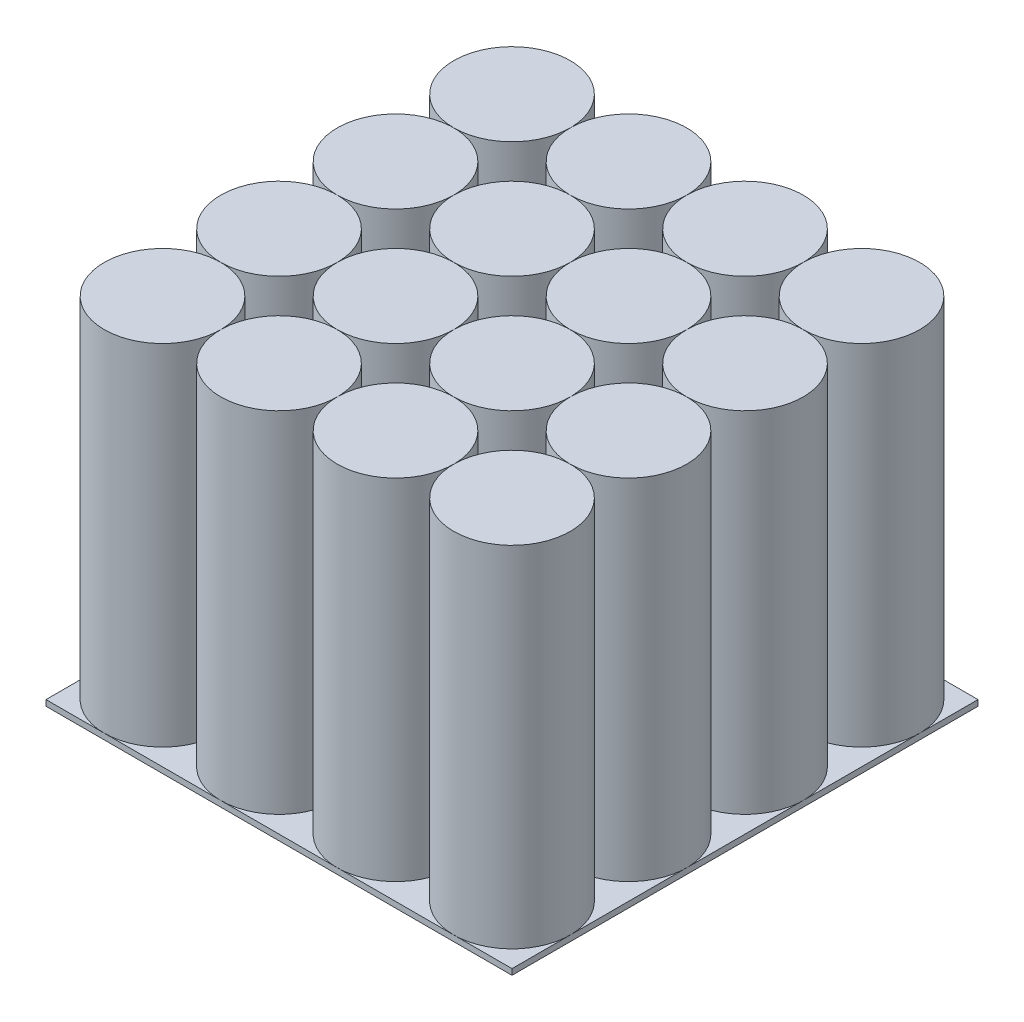
ISO-10303-21;
HEADER;
FILE_DESCRIPTION(('STEP AP214'),'2;1');
FILE_NAME('part.step','',(''),(''),'','','');
FILE_SCHEMA(('AUTOMOTIVE_DESIGN { 1 0 10303 214 1 1 1 1 }'));
ENDSEC;
DATA;
#1=APPLICATION_CONTEXT('core data for automotive mechanical design processes');
#2=APPLICATION_PROTOCOL_DEFINITION('international standard','automotive_design',2000,#1);
#3=PRODUCT_CONTEXT('',#1,'mechanical');
#4=PRODUCT('Part','Part','',(#3));
#5=PRODUCT_RELATED_PRODUCT_CATEGORY('part','',(#4));
#6=PRODUCT_DEFINITION_FORMATION('','',#4);
#7=PRODUCT_DEFINITION_CONTEXT('part definition',#1,'design');
#8=PRODUCT_DEFINITION('design','',#6,#7);
#9=PRODUCT_DEFINITION_SHAPE('','',#8);
#10=(LENGTH_UNIT() NAMED_UNIT(*) SI_UNIT(.MILLI.,.METRE.));
#11=(NAMED_UNIT(*) PLANE_ANGLE_UNIT() SI_UNIT($,.RADIAN.));
#12=(NAMED_UNIT(*) SI_UNIT($,.STERADIAN.) SOLID_ANGLE_UNIT());
#13=UNCERTAINTY_MEASURE_WITH_UNIT(LENGTH_MEASURE(1.E-05),#10,'distance_accuracy_value','');
#14=(GEOMETRIC_REPRESENTATION_CONTEXT(3) GLOBAL_UNCERTAINTY_ASSIGNED_CONTEXT((#13)) GLOBAL_UNIT_ASSIGNED_CONTEXT((#10,
#11,#12)) REPRESENTATION_CONTEXT('',''));
#15=CARTESIAN_POINT('',(0.,0.,0.));
#16=DIRECTION('',(0.,0.,1.));
#17=DIRECTION('',(1.,0.,0.));
#18=AXIS2_PLACEMENT_3D('',#15,#16,#17);
#19=CARTESIAN_POINT('',(7.,6.,-7.));
#20=DIRECTION('',(0.,-1.,0.));
#21=DIRECTION('',(0.,0.,-1.));
#22=AXIS2_PLACEMENT_3D('',#19,#20,#21);
#23=CYLINDRICAL_SURFACE('',#22,1.);
#24=CARTESIAN_POINT('',(7.,6.,-7.));
#25=DIRECTION('',(0.,1.,0.));
#26=DIRECTION('',(0.,0.,1.));
#27=AXIS2_PLACEMENT_3D('',#24,#25,#26);
#28=CIRCLE('',#27,1.);
#29=CARTESIAN_POINT('',(7.,6.,-6.));
#30=VERTEX_POINT('',#29);
#31=EDGE_CURVE('E12',#30,#30,#28,.T.);
#32=ORIENTED_EDGE('',*,*,#31,.F.);
#33=EDGE_LOOP('',(#32));
#34=FACE_BOUND('',#33,.T.);
#35=CARTESIAN_POINT('',(7.,0.,-7.));
#36=DIRECTION('',(0.,1.,0.));
#37=DIRECTION('',(0.,0.,1.));
#38=AXIS2_PLACEMENT_3D('',#35,#36,#37);
#39=CIRCLE('',#38,1.);
#40=CARTESIAN_POINT('',(7.,0.,-6.));
#41=VERTEX_POINT('',#40);
#42=EDGE_CURVE('E159',#41,#41,#39,.T.);
#43=ORIENTED_EDGE('',*,*,#42,.T.);
#44=EDGE_LOOP('',(#43));
#45=FACE_BOUND('',#44,.T.);
#46=ADVANCED_FACE('F156',(#34,#45),#23,.T.);
#47=CARTESIAN_POINT('',(0.,6.,0.));
#48=DIRECTION('',(0.,1.,0.));
#49=DIRECTION('',(0.,0.,1.));
#50=AXIS2_PLACEMENT_3D('',#47,#48,#49);
#51=PLANE('',#50);
#52=ORIENTED_EDGE('',*,*,#31,.T.);
#53=EDGE_LOOP('',(#52));
#54=FACE_BOUND('',#53,.T.);
#55=ADVANCED_FACE('F171',(#54),#51,.T.);
#56=CARTESIAN_POINT('',(0.,0.,0.));
#57=DIRECTION('',(0.,1.,0.));
#58=DIRECTION('',(0.,0.,1.));
#59=AXIS2_PLACEMENT_3D('',#56,#57,#58);
#60=PLANE('',#59);
#61=ORIENTED_EDGE('',*,*,#42,.F.);
#62=EDGE_LOOP('',(#61));
#63=FACE_BOUND('',#62,.T.);
#64=ADVANCED_FACE('F169',(#63),#60,.F.);
#65=CLOSED_SHELL('',(#46,#55,#64));
#66=MANIFOLD_SOLID_BREP('B2',#65);
#67=CARTESIAN_POINT('',(7.00000000000002,6.,-5.));
#68=DIRECTION('',(0.,-1.,0.));
#69=DIRECTION('',(0.,0.,-1.));
#70=AXIS2_PLACEMENT_3D('',#67,#68,#69);
#71=CYLINDRICAL_SURFACE('',#70,1.);
#72=CARTESIAN_POINT('',(7.00000000000002,6.,-5.));
#73=DIRECTION('',(0.,1.,0.));
#74=DIRECTION('',(0.,0.,1.));
#75=AXIS2_PLACEMENT_3D('',#72,#73,#74);
#76=CIRCLE('',#75,1.);
#77=CARTESIAN_POINT('',(7.00000000000002,6.,-4.));
#78=VERTEX_POINT('',#77);
#79=EDGE_CURVE('E155',#78,#78,#76,.T.);
#80=ORIENTED_EDGE('',*,*,#79,.F.);
#81=EDGE_LOOP('',(#80));
#82=FACE_BOUND('',#81,.T.);
#83=CARTESIAN_POINT('',(7.00000000000002,0.,-5.));
#84=DIRECTION('',(0.,1.,0.));
#85=DIRECTION('',(0.,0.,1.));
#86=AXIS2_PLACEMENT_3D('',#83,#84,#85);
#87=CIRCLE('',#86,1.);
#88=CARTESIAN_POINT('',(7.00000000000002,0.,-4.));
#89=VERTEX_POINT('',#88);
#90=EDGE_CURVE('E208',#89,#89,#87,.T.);
#91=ORIENTED_EDGE('',*,*,#90,.T.);
#92=EDGE_LOOP('',(#91));
#93=FACE_BOUND('',#92,.T.);
#94=ADVANCED_FACE('F205',(#82,#93),#71,.T.);
#95=CARTESIAN_POINT('',(0.,6.,0.));
#96=DIRECTION('',(0.,1.,0.));
#97=DIRECTION('',(0.,0.,1.));
#98=AXIS2_PLACEMENT_3D('',#95,#96,#97);
#99=PLANE('',#98);
#100=ORIENTED_EDGE('',*,*,#79,.T.);
#101=EDGE_LOOP('',(#100));
#102=FACE_BOUND('',#101,.T.);
#103=ADVANCED_FACE('F220',(#102),#99,.T.);
#104=CARTESIAN_POINT('',(0.,0.,0.));
#105=DIRECTION('',(0.,1.,0.));
#106=DIRECTION('',(0.,0.,1.));
#107=AXIS2_PLACEMENT_3D('',#104,#105,#106);
#108=PLANE('',#107);
#109=ORIENTED_EDGE('',*,*,#90,.F.);
#110=EDGE_LOOP('',(#109));
#111=FACE_BOUND('',#110,.T.);
#112=ADVANCED_FACE('F218',(#111),#108,.F.);
#113=CLOSED_SHELL('',(#94,#103,#112));
#114=MANIFOLD_SOLID_BREP('B7',#113);
#115=CARTESIAN_POINT('',(7.00000000000004,6.,-3.));
#116=DIRECTION('',(0.,-1.,0.));
#117=DIRECTION('',(0.,0.,-1.));
#118=AXIS2_PLACEMENT_3D('',#115,#116,#117);
#119=CYLINDRICAL_SURFACE('',#118,1.);
#120=CARTESIAN_POINT('',(7.00000000000004,6.,-3.));
#121=DIRECTION('',(0.,1.,0.));
#122=DIRECTION('',(0.,0.,1.));
#123=AXIS2_PLACEMENT_3D('',#120,#121,#122);
#124=CIRCLE('',#123,1.);
#125=CARTESIAN_POINT('',(7.00000000000004,6.,-2.));
#126=VERTEX_POINT('',#125);
#127=EDGE_CURVE('E204',#126,#126,#124,.T.);
#128=ORIENTED_EDGE('',*,*,#127,.F.);
#129=EDGE_LOOP('',(#128));
#130=FACE_BOUND('',#129,.T.);
#131=CARTESIAN_POINT('',(7.00000000000004,0.,-3.));
#132=DIRECTION('',(0.,1.,0.));
#133=DIRECTION('',(0.,0.,1.));
#134=AXIS2_PLACEMENT_3D('',#131,#132,#133);
#135=CIRCLE('',#134,1.);
#136=CARTESIAN_POINT('',(7.00000000000004,0.,-2.));
#137=VERTEX_POINT('',#136);
#138=EDGE_CURVE('E257',#137,#137,#135,.T.);
#139=ORIENTED_EDGE('',*,*,#138,.T.);
#140=EDGE_LOOP('',(#139));
#141=FACE_BOUND('',#140,.T.);
#142=ADVANCED_FACE('F254',(#130,#141),#119,.T.);
#143=CARTESIAN_POINT('',(0.,6.,0.));
#144=DIRECTION('',(0.,1.,0.));
#145=DIRECTION('',(0.,0.,1.));
#146=AXIS2_PLACEMENT_3D('',#143,#144,#145);
#147=PLANE('',#146);
#148=ORIENTED_EDGE('',*,*,#127,.T.);
#149=EDGE_LOOP('',(#148));
#150=FACE_BOUND('',#149,.T.);
#151=ADVANCED_FACE('F269',(#150),#147,.T.);
#152=CARTESIAN_POINT('',(0.,0.,0.));
#153=DIRECTION('',(0.,1.,0.));
#154=DIRECTION('',(0.,0.,1.));
#155=AXIS2_PLACEMENT_3D('',#152,#153,#154);
#156=PLANE('',#155);
#157=ORIENTED_EDGE('',*,*,#138,.F.);
#158=EDGE_LOOP('',(#157));
#159=FACE_BOUND('',#158,.T.);
#160=ADVANCED_FACE('F267',(#159),#156,.F.);
#161=CLOSED_SHELL('',(#142,#151,#160));
#162=MANIFOLD_SOLID_BREP('B150',#161);
#163=CARTESIAN_POINT('',(7.00000000000006,6.,-1.));
#164=DIRECTION('',(0.,-1.,0.));
#165=DIRECTION('',(0.,0.,-1.));
#166=AXIS2_PLACEMENT_3D('',#163,#164,#165);
#167=CYLINDRICAL_SURFACE('',#166,1.);
#168=CARTESIAN_POINT('',(7.00000000000006,6.,-1.));
#169=DIRECTION('',(0.,1.,0.));
#170=DIRECTION('',(0.,0.,1.));
#171=AXIS2_PLACEMENT_3D('',#168,#169,#170);
#172=CIRCLE('',#171,1.);
#173=CARTESIAN_POINT('',(7.00000000000006,6.,0.));
#174=VERTEX_POINT('',#173);
#175=EDGE_CURVE('E253',#174,#174,#172,.T.);
#176=ORIENTED_EDGE('',*,*,#175,.F.);
#177=EDGE_LOOP('',(#176));
#178=FACE_BOUND('',#177,.T.);
#179=CARTESIAN_POINT('',(7.00000000000006,0.,-1.));
#180=DIRECTION('',(0.,1.,0.));
#181=DIRECTION('',(0.,0.,1.));
#182=AXIS2_PLACEMENT_3D('',#179,#180,#181);
#183=CIRCLE('',#182,1.);
#184=CARTESIAN_POINT('',(7.00000000000006,0.,0.));
#185=VERTEX_POINT('',#184);
#186=EDGE_CURVE('E306',#185,#185,#183,.T.);
#187=ORIENTED_EDGE('',*,*,#186,.T.);
#188=EDGE_LOOP('',(#187));
#189=FACE_BOUND('',#188,.T.);
#190=ADVANCED_FACE('F303',(#178,#189),#167,.T.);
#191=CARTESIAN_POINT('',(0.,6.,0.));
#192=DIRECTION('',(0.,1.,0.));
#193=DIRECTION('',(0.,0.,1.));
#194=AXIS2_PLACEMENT_3D('',#191,#192,#193);
#195=PLANE('',#194);
#196=ORIENTED_EDGE('',*,*,#175,.T.);
#197=EDGE_LOOP('',(#196));
#198=FACE_BOUND('',#197,.T.);
#199=ADVANCED_FACE('F318',(#198),#195,.T.);
#200=CARTESIAN_POINT('',(0.,0.,0.));
#201=DIRECTION('',(0.,1.,0.));
#202=DIRECTION('',(0.,0.,1.));
#203=AXIS2_PLACEMENT_3D('',#200,#201,#202);
#204=PLANE('',#203);
#205=ORIENTED_EDGE('',*,*,#186,.F.);
#206=EDGE_LOOP('',(#205));
#207=FACE_BOUND('',#206,.T.);
#208=ADVANCED_FACE('F316',(#207),#204,.F.);
#209=CLOSED_SHELL('',(#190,#199,#208));
#210=MANIFOLD_SOLID_BREP('B199',#209);
#211=CARTESIAN_POINT('',(5.00000000000004,6.,-3.));
#212=DIRECTION('',(0.,-1.,0.));
#213=DIRECTION('',(0.,0.,-1.));
#214=AXIS2_PLACEMENT_3D('',#211,#212,#213);
#215=CYLINDRICAL_SURFACE('',#214,1.);
#216=CARTESIAN_POINT('',(5.00000000000004,6.,-3.));
#217=DIRECTION('',(0.,1.,0.));
#218=DIRECTION('',(0.,0.,1.));
#219=AXIS2_PLACEMENT_3D('',#216,#217,#218);
#220=CIRCLE('',#219,1.);
#221=CARTESIAN_POINT('',(5.00000000000004,6.,-2.));
#222=VERTEX_POINT('',#221);
#223=EDGE_CURVE('E302',#222,#222,#220,.T.);
#224=ORIENTED_EDGE('',*,*,#223,.F.);
#225=EDGE_LOOP('',(#224));
#226=FACE_BOUND('',#225,.T.);
#227=CARTESIAN_POINT('',(5.00000000000004,0.,-3.));
#228=DIRECTION('',(0.,1.,0.));
#229=DIRECTION('',(0.,0.,1.));
#230=AXIS2_PLACEMENT_3D('',#227,#228,#229);
#231=CIRCLE('',#230,1.);
#232=CARTESIAN_POINT('',(5.00000000000004,0.,-2.));
#233=VERTEX_POINT('',#232);
#234=EDGE_CURVE('E355',#233,#233,#231,.T.);
#235=ORIENTED_EDGE('',*,*,#234,.T.);
#236=EDGE_LOOP('',(#235));
#237=FACE_BOUND('',#236,.T.);
#238=ADVANCED_FACE('F352',(#226,#237),#215,.T.);
#239=CARTESIAN_POINT('',(0.,6.,0.));
#240=DIRECTION('',(0.,1.,0.));
#241=DIRECTION('',(0.,0.,1.));
#242=AXIS2_PLACEMENT_3D('',#239,#240,#241);
#243=PLANE('',#242);
#244=ORIENTED_EDGE('',*,*,#223,.T.);
#245=EDGE_LOOP('',(#244));
#246=FACE_BOUND('',#245,.T.);
#247=ADVANCED_FACE('F367',(#246),#243,.T.);
#248=CARTESIAN_POINT('',(0.,0.,0.));
#249=DIRECTION('',(0.,1.,0.));
#250=DIRECTION('',(0.,0.,1.));
#251=AXIS2_PLACEMENT_3D('',#248,#249,#250);
#252=PLANE('',#251);
#253=ORIENTED_EDGE('',*,*,#234,.F.);
#254=EDGE_LOOP('',(#253));
#255=FACE_BOUND('',#254,.T.);
#256=ADVANCED_FACE('F365',(#255),#252,.F.);
#257=CLOSED_SHELL('',(#238,#247,#256));
#258=MANIFOLD_SOLID_BREP('B248',#257);
#259=CARTESIAN_POINT('',(5.00000000000006,6.,-1.));
#260=DIRECTION('',(0.,-1.,0.));
#261=DIRECTION('',(0.,0.,-1.));
#262=AXIS2_PLACEMENT_3D('',#259,#260,#261);
#263=CYLINDRICAL_SURFACE('',#262,1.);
#264=CARTESIAN_POINT('',(5.00000000000006,6.,-1.));
#265=DIRECTION('',(0.,1.,0.));
#266=DIRECTION('',(0.,0.,1.));
#267=AXIS2_PLACEMENT_3D('',#264,#265,#266);
#268=CIRCLE('',#267,1.);
#269=CARTESIAN_POINT('',(5.00000000000006,6.,0.));
#270=VERTEX_POINT('',#269);
#271=EDGE_CURVE('E351',#270,#270,#268,.T.);
#272=ORIENTED_EDGE('',*,*,#271,.F.);
#273=EDGE_LOOP('',(#272));
#274=FACE_BOUND('',#273,.T.);
#275=CARTESIAN_POINT('',(5.00000000000006,0.,-1.));
#276=DIRECTION('',(0.,1.,0.));
#277=DIRECTION('',(0.,0.,1.));
#278=AXIS2_PLACEMENT_3D('',#275,#276,#277);
#279=CIRCLE('',#278,1.);
#280=CARTESIAN_POINT('',(5.00000000000006,0.,0.));
#281=VERTEX_POINT('',#280);
#282=EDGE_CURVE('E404',#281,#281,#279,.T.);
#283=ORIENTED_EDGE('',*,*,#282,.T.);
#284=EDGE_LOOP('',(#283));
#285=FACE_BOUND('',#284,.T.);
#286=ADVANCED_FACE('F401',(#274,#285),#263,.T.);
#287=CARTESIAN_POINT('',(0.,6.,0.));
#288=DIRECTION('',(0.,1.,0.));
#289=DIRECTION('',(0.,0.,1.));
#290=AXIS2_PLACEMENT_3D('',#287,#288,#289);
#291=PLANE('',#290);
#292=ORIENTED_EDGE('',*,*,#271,.T.);
#293=EDGE_LOOP('',(#292));
#294=FACE_BOUND('',#293,.T.);
#295=ADVANCED_FACE('F416',(#294),#291,.T.);
#296=CARTESIAN_POINT('',(0.,0.,0.));
#297=DIRECTION('',(0.,1.,0.));
#298=DIRECTION('',(0.,0.,1.));
#299=AXIS2_PLACEMENT_3D('',#296,#297,#298);
#300=PLANE('',#299);
#301=ORIENTED_EDGE('',*,*,#282,.F.);
#302=EDGE_LOOP('',(#301));
#303=FACE_BOUND('',#302,.T.);
#304=ADVANCED_FACE('F414',(#303),#300,.F.);
#305=CLOSED_SHELL('',(#286,#295,#304));
#306=MANIFOLD_SOLID_BREP('B297',#305);
#307=CARTESIAN_POINT('',(3.00000000000004,6.,-3.));
#308=DIRECTION('',(0.,-1.,0.));
#309=DIRECTION('',(0.,0.,-1.));
#310=AXIS2_PLACEMENT_3D('',#307,#308,#309);
#311=CYLINDRICAL_SURFACE('',#310,1.);
#312=CARTESIAN_POINT('',(3.00000000000004,6.,-3.));
#313=DIRECTION('',(0.,1.,0.));
#314=DIRECTION('',(0.,0.,1.));
#315=AXIS2_PLACEMENT_3D('',#312,#313,#314);
#316=CIRCLE('',#315,1.);
#317=CARTESIAN_POINT('',(3.00000000000004,6.,-2.));
#318=VERTEX_POINT('',#317);
#319=EDGE_CURVE('E400',#318,#318,#316,.T.);
#320=ORIENTED_EDGE('',*,*,#319,.F.);
#321=EDGE_LOOP('',(#320));
#322=FACE_BOUND('',#321,.T.);
#323=CARTESIAN_POINT('',(3.00000000000004,0.,-3.));
#324=DIRECTION('',(0.,1.,0.));
#325=DIRECTION('',(0.,0.,1.));
#326=AXIS2_PLACEMENT_3D('',#323,#324,#325);
#327=CIRCLE('',#326,1.);
#328=CARTESIAN_POINT('',(3.00000000000004,0.,-2.));
#329=VERTEX_POINT('',#328);
#330=EDGE_CURVE('E453',#329,#329,#327,.T.);
#331=ORIENTED_EDGE('',*,*,#330,.T.);
#332=EDGE_LOOP('',(#331));
#333=FACE_BOUND('',#332,.T.);
#334=ADVANCED_FACE('F450',(#322,#333),#311,.T.);
#335=CARTESIAN_POINT('',(0.,6.,0.));
#336=DIRECTION('',(0.,1.,0.));
#337=DIRECTION('',(0.,0.,1.));
#338=AXIS2_PLACEMENT_3D('',#335,#336,#337);
#339=PLANE('',#338);
#340=ORIENTED_EDGE('',*,*,#319,.T.);
#341=EDGE_LOOP('',(#340));
#342=FACE_BOUND('',#341,.T.);
#343=ADVANCED_FACE('F465',(#342),#339,.T.);
#344=CARTESIAN_POINT('',(0.,0.,0.));
#345=DIRECTION('',(0.,1.,0.));
#346=DIRECTION('',(0.,0.,1.));
#347=AXIS2_PLACEMENT_3D('',#344,#345,#346);
#348=PLANE('',#347);
#349=ORIENTED_EDGE('',*,*,#330,.F.);
#350=EDGE_LOOP('',(#349));
#351=FACE_BOUND('',#350,.T.);
#352=ADVANCED_FACE('F463',(#351),#348,.F.);
#353=CLOSED_SHELL('',(#334,#343,#352));
#354=MANIFOLD_SOLID_BREP('B346',#353);
#355=CARTESIAN_POINT('',(3.00000000000006,6.,-1.));
#356=DIRECTION('',(0.,-1.,0.));
#357=DIRECTION('',(0.,0.,-1.));
#358=AXIS2_PLACEMENT_3D('',#355,#356,#357);
#359=CYLINDRICAL_SURFACE('',#358,1.);
#360=CARTESIAN_POINT('',(3.00000000000006,6.,-1.));
#361=DIRECTION('',(0.,1.,0.));
#362=DIRECTION('',(0.,0.,1.));
#363=AXIS2_PLACEMENT_3D('',#360,#361,#362);
#364=CIRCLE('',#363,1.);
#365=CARTESIAN_POINT('',(3.00000000000006,6.,0.));
#366=VERTEX_POINT('',#365);
#367=EDGE_CURVE('E449',#366,#366,#364,.T.);
#368=ORIENTED_EDGE('',*,*,#367,.F.);
#369=EDGE_LOOP('',(#368));
#370=FACE_BOUND('',#369,.T.);
#371=CARTESIAN_POINT('',(3.00000000000006,0.,-1.));
#372=DIRECTION('',(0.,1.,0.));
#373=DIRECTION('',(0.,0.,1.));
#374=AXIS2_PLACEMENT_3D('',#371,#372,#373);
#375=CIRCLE('',#374,1.);
#376=CARTESIAN_POINT('',(3.00000000000006,0.,0.));
#377=VERTEX_POINT('',#376);
#378=EDGE_CURVE('E502',#377,#377,#375,.T.);
#379=ORIENTED_EDGE('',*,*,#378,.T.);
#380=EDGE_LOOP('',(#379));
#381=FACE_BOUND('',#380,.T.);
#382=ADVANCED_FACE('F499',(#370,#381),#359,.T.);
#383=CARTESIAN_POINT('',(0.,6.,0.));
#384=DIRECTION('',(0.,1.,0.));
#385=DIRECTION('',(0.,0.,1.));
#386=AXIS2_PLACEMENT_3D('',#383,#384,#385);
#387=PLANE('',#386);
#388=ORIENTED_EDGE('',*,*,#367,.T.);
#389=EDGE_LOOP('',(#388));
#390=FACE_BOUND('',#389,.T.);
#391=ADVANCED_FACE('F514',(#390),#387,.T.);
#392=CARTESIAN_POINT('',(0.,0.,0.));
#393=DIRECTION('',(0.,1.,0.));
#394=DIRECTION('',(0.,0.,1.));
#395=AXIS2_PLACEMENT_3D('',#392,#393,#394);
#396=PLANE('',#395);
#397=ORIENTED_EDGE('',*,*,#378,.F.);
#398=EDGE_LOOP('',(#397));
#399=FACE_BOUND('',#398,.T.);
#400=ADVANCED_FACE('F512',(#399),#396,.F.);
#401=CLOSED_SHELL('',(#382,#391,#400));
#402=MANIFOLD_SOLID_BREP('B395',#401);
#403=CARTESIAN_POINT('',(1.00000000000006,6.,-1.));
#404=DIRECTION('',(0.,-1.,0.));
#405=DIRECTION('',(0.,0.,-1.));
#406=AXIS2_PLACEMENT_3D('',#403,#404,#405);
#407=CYLINDRICAL_SURFACE('',#406,1.);
#408=CARTESIAN_POINT('',(1.00000000000006,6.,-1.));
#409=DIRECTION('',(0.,1.,0.));
#410=DIRECTION('',(0.,0.,1.));
#411=AXIS2_PLACEMENT_3D('',#408,#409,#410);
#412=CIRCLE('',#411,1.);
#413=CARTESIAN_POINT('',(1.00000000000006,6.,0.));
#414=VERTEX_POINT('',#413);
#415=EDGE_CURVE('E498',#414,#414,#412,.T.);
#416=ORIENTED_EDGE('',*,*,#415,.F.);
#417=EDGE_LOOP('',(#416));
#418=FACE_BOUND('',#417,.T.);
#419=CARTESIAN_POINT('',(1.00000000000006,0.,-1.));
#420=DIRECTION('',(0.,1.,0.));
#421=DIRECTION('',(0.,0.,1.));
#422=AXIS2_PLACEMENT_3D('',#419,#420,#421);
#423=CIRCLE('',#422,1.);
#424=CARTESIAN_POINT('',(1.00000000000006,0.,0.));
#425=VERTEX_POINT('',#424);
#426=EDGE_CURVE('E551',#425,#425,#423,.T.);
#427=ORIENTED_EDGE('',*,*,#426,.T.);
#428=EDGE_LOOP('',(#427));
#429=FACE_BOUND('',#428,.T.);
#430=ADVANCED_FACE('F548',(#418,#429),#407,.T.);
#431=CARTESIAN_POINT('',(0.,6.,0.));
#432=DIRECTION('',(0.,1.,0.));
#433=DIRECTION('',(0.,0.,1.));
#434=AXIS2_PLACEMENT_3D('',#431,#432,#433);
#435=PLANE('',#434);
#436=ORIENTED_EDGE('',*,*,#415,.T.);
#437=EDGE_LOOP('',(#436));
#438=FACE_BOUND('',#437,.T.);
#439=ADVANCED_FACE('F563',(#438),#435,.T.);
#440=CARTESIAN_POINT('',(0.,0.,0.));
#441=DIRECTION('',(0.,1.,0.));
#442=DIRECTION('',(0.,0.,1.));
#443=AXIS2_PLACEMENT_3D('',#440,#441,#442);
#444=PLANE('',#443);
#445=ORIENTED_EDGE('',*,*,#426,.F.);
#446=EDGE_LOOP('',(#445));
#447=FACE_BOUND('',#446,.T.);
#448=ADVANCED_FACE('F561',(#447),#444,.F.);
#449=CLOSED_SHELL('',(#430,#439,#448));
#450=MANIFOLD_SOLID_BREP('B444',#449);
#451=CARTESIAN_POINT('',(1.00000000000004,6.,-3.));
#452=DIRECTION('',(0.,-1.,0.));
#453=DIRECTION('',(0.,0.,-1.));
#454=AXIS2_PLACEMENT_3D('',#451,#452,#453);
#455=CYLINDRICAL_SURFACE('',#454,1.);
#456=CARTESIAN_POINT('',(1.00000000000004,6.,-3.));
#457=DIRECTION('',(0.,1.,0.));
#458=DIRECTION('',(0.,0.,1.));
#459=AXIS2_PLACEMENT_3D('',#456,#457,#458);
#460=CIRCLE('',#459,1.);
#461=CARTESIAN_POINT('',(1.00000000000004,6.,-2.));
#462=VERTEX_POINT('',#461);
#463=EDGE_CURVE('E547',#462,#462,#460,.T.);
#464=ORIENTED_EDGE('',*,*,#463,.F.);
#465=EDGE_LOOP('',(#464));
#466=FACE_BOUND('',#465,.T.);
#467=CARTESIAN_POINT('',(1.00000000000004,0.,-3.));
#468=DIRECTION('',(0.,1.,0.));
#469=DIRECTION('',(0.,0.,1.));
#470=AXIS2_PLACEMENT_3D('',#467,#468,#469);
#471=CIRCLE('',#470,1.);
#472=CARTESIAN_POINT('',(1.00000000000004,0.,-2.));
#473=VERTEX_POINT('',#472);
#474=EDGE_CURVE('E600',#473,#473,#471,.T.);
#475=ORIENTED_EDGE('',*,*,#474,.T.);
#476=EDGE_LOOP('',(#475));
#477=FACE_BOUND('',#476,.T.);
#478=ADVANCED_FACE('F597',(#466,#477),#455,.T.);
#479=CARTESIAN_POINT('',(0.,6.,0.));
#480=DIRECTION('',(0.,1.,0.));
#481=DIRECTION('',(0.,0.,1.));
#482=AXIS2_PLACEMENT_3D('',#479,#480,#481);
#483=PLANE('',#482);
#484=ORIENTED_EDGE('',*,*,#463,.T.);
#485=EDGE_LOOP('',(#484));
#486=FACE_BOUND('',#485,.T.);
#487=ADVANCED_FACE('F612',(#486),#483,.T.);
#488=CARTESIAN_POINT('',(0.,0.,0.));
#489=DIRECTION('',(0.,1.,0.));
#490=DIRECTION('',(0.,0.,1.));
#491=AXIS2_PLACEMENT_3D('',#488,#489,#490);
#492=PLANE('',#491);
#493=ORIENTED_EDGE('',*,*,#474,.F.);
#494=EDGE_LOOP('',(#493));
#495=FACE_BOUND('',#494,.T.);
#496=ADVANCED_FACE('F610',(#495),#492,.F.);
#497=CLOSED_SHELL('',(#478,#487,#496));
#498=MANIFOLD_SOLID_BREP('B493',#497);
#499=CARTESIAN_POINT('',(1.00000000000002,6.,-5.));
#500=DIRECTION('',(0.,-1.,0.));
#501=DIRECTION('',(0.,0.,-1.));
#502=AXIS2_PLACEMENT_3D('',#499,#500,#501);
#503=CYLINDRICAL_SURFACE('',#502,1.);
#504=CARTESIAN_POINT('',(1.00000000000002,6.,-5.));
#505=DIRECTION('',(0.,1.,0.));
#506=DIRECTION('',(0.,0.,1.));
#507=AXIS2_PLACEMENT_3D('',#504,#505,#506);
#508=CIRCLE('',#507,1.);
#509=CARTESIAN_POINT('',(1.00000000000002,6.,-4.));
#510=VERTEX_POINT('',#509);
#511=EDGE_CURVE('E596',#510,#510,#508,.T.);
#512=ORIENTED_EDGE('',*,*,#511,.F.);
#513=EDGE_LOOP('',(#512));
#514=FACE_BOUND('',#513,.T.);
#515=CARTESIAN_POINT('',(1.00000000000002,0.,-5.));
#516=DIRECTION('',(0.,1.,0.));
#517=DIRECTION('',(0.,0.,1.));
#518=AXIS2_PLACEMENT_3D('',#515,#516,#517);
#519=CIRCLE('',#518,1.);
#520=CARTESIAN_POINT('',(1.00000000000002,0.,-4.));
#521=VERTEX_POINT('',#520);
#522=EDGE_CURVE('E649',#521,#521,#519,.T.);
#523=ORIENTED_EDGE('',*,*,#522,.T.);
#524=EDGE_LOOP('',(#523));
#525=FACE_BOUND('',#524,.T.);
#526=ADVANCED_FACE('F646',(#514,#525),#503,.T.);
#527=CARTESIAN_POINT('',(0.,6.,0.));
#528=DIRECTION('',(0.,1.,0.));
#529=DIRECTION('',(0.,0.,1.));
#530=AXIS2_PLACEMENT_3D('',#527,#528,#529);
#531=PLANE('',#530);
#532=ORIENTED_EDGE('',*,*,#511,.T.);
#533=EDGE_LOOP('',(#532));
#534=FACE_BOUND('',#533,.T.);
#535=ADVANCED_FACE('F661',(#534),#531,.T.);
#536=CARTESIAN_POINT('',(0.,0.,0.));
#537=DIRECTION('',(0.,1.,0.));
#538=DIRECTION('',(0.,0.,1.));
#539=AXIS2_PLACEMENT_3D('',#536,#537,#538);
#540=PLANE('',#539);
#541=ORIENTED_EDGE('',*,*,#522,.F.);
#542=EDGE_LOOP('',(#541));
#543=FACE_BOUND('',#542,.T.);
#544=ADVANCED_FACE('F659',(#543),#540,.F.);
#545=CLOSED_SHELL('',(#526,#535,#544));
#546=MANIFOLD_SOLID_BREP('B542',#545);
#547=CARTESIAN_POINT('',(3.00000000000002,6.,-5.));
#548=DIRECTION('',(0.,-1.,0.));
#549=DIRECTION('',(0.,0.,-1.));
#550=AXIS2_PLACEMENT_3D('',#547,#548,#549);
#551=CYLINDRICAL_SURFACE('',#550,1.);
#552=CARTESIAN_POINT('',(3.00000000000002,6.,-5.));
#553=DIRECTION('',(0.,1.,0.));
#554=DIRECTION('',(0.,0.,1.));
#555=AXIS2_PLACEMENT_3D('',#552,#553,#554);
#556=CIRCLE('',#555,1.);
#557=CARTESIAN_POINT('',(3.00000000000002,6.,-4.));
#558=VERTEX_POINT('',#557);
#559=EDGE_CURVE('E645',#558,#558,#556,.T.);
#560=ORIENTED_EDGE('',*,*,#559,.F.);
#561=EDGE_LOOP('',(#560));
#562=FACE_BOUND('',#561,.T.);
#563=CARTESIAN_POINT('',(3.00000000000002,0.,-5.));
#564=DIRECTION('',(0.,1.,0.));
#565=DIRECTION('',(0.,0.,1.));
#566=AXIS2_PLACEMENT_3D('',#563,#564,#565);
#567=CIRCLE('',#566,1.);
#568=CARTESIAN_POINT('',(3.00000000000002,0.,-4.));
#569=VERTEX_POINT('',#568);
#570=EDGE_CURVE('E698',#569,#569,#567,.T.);
#571=ORIENTED_EDGE('',*,*,#570,.T.);
#572=EDGE_LOOP('',(#571));
#573=FACE_BOUND('',#572,.T.);
#574=ADVANCED_FACE('F695',(#562,#573),#551,.T.);
#575=CARTESIAN_POINT('',(0.,6.,0.));
#576=DIRECTION('',(0.,1.,0.));
#577=DIRECTION('',(0.,0.,1.));
#578=AXIS2_PLACEMENT_3D('',#575,#576,#577);
#579=PLANE('',#578);
#580=ORIENTED_EDGE('',*,*,#559,.T.);
#581=EDGE_LOOP('',(#580));
#582=FACE_BOUND('',#581,.T.);
#583=ADVANCED_FACE('F710',(#582),#579,.T.);
#584=CARTESIAN_POINT('',(0.,0.,0.));
#585=DIRECTION('',(0.,1.,0.));
#586=DIRECTION('',(0.,0.,1.));
#587=AXIS2_PLACEMENT_3D('',#584,#585,#586);
#588=PLANE('',#587);
#589=ORIENTED_EDGE('',*,*,#570,.F.);
#590=EDGE_LOOP('',(#589));
#591=FACE_BOUND('',#590,.T.);
#592=ADVANCED_FACE('F708',(#591),#588,.F.);
#593=CLOSED_SHELL('',(#574,#583,#592));
#594=MANIFOLD_SOLID_BREP('B591',#593);
#595=CARTESIAN_POINT('',(3.,6.,-7.));
#596=DIRECTION('',(0.,-1.,0.));
#597=DIRECTION('',(0.,0.,-1.));
#598=AXIS2_PLACEMENT_3D('',#595,#596,#597);
#599=CYLINDRICAL_SURFACE('',#598,1.);
#600=CARTESIAN_POINT('',(3.,6.,-7.));
#601=DIRECTION('',(0.,1.,0.));
#602=DIRECTION('',(0.,0.,1.));
#603=AXIS2_PLACEMENT_3D('',#600,#601,#602);
#604=CIRCLE('',#603,1.);
#605=CARTESIAN_POINT('',(3.,6.,-6.));
#606=VERTEX_POINT('',#605);
#607=EDGE_CURVE('E694',#606,#606,#604,.T.);
#608=ORIENTED_EDGE('',*,*,#607,.F.);
#609=EDGE_LOOP('',(#608));
#610=FACE_BOUND('',#609,.T.);
#611=CARTESIAN_POINT('',(3.,0.,-7.));
#612=DIRECTION('',(0.,1.,0.));
#613=DIRECTION('',(0.,0.,1.));
#614=AXIS2_PLACEMENT_3D('',#611,#612,#613);
#615=CIRCLE('',#614,1.);
#616=CARTESIAN_POINT('',(3.,0.,-6.));
#617=VERTEX_POINT('',#616);
#618=EDGE_CURVE('E747',#617,#617,#615,.T.);
#619=ORIENTED_EDGE('',*,*,#618,.T.);
#620=EDGE_LOOP('',(#619));
#621=FACE_BOUND('',#620,.T.);
#622=ADVANCED_FACE('F744',(#610,#621),#599,.T.);
#623=CARTESIAN_POINT('',(0.,6.,0.));
#624=DIRECTION('',(0.,1.,0.));
#625=DIRECTION('',(0.,0.,1.));
#626=AXIS2_PLACEMENT_3D('',#623,#624,#625);
#627=PLANE('',#626);
#628=ORIENTED_EDGE('',*,*,#607,.T.);
#629=EDGE_LOOP('',(#628));
#630=FACE_BOUND('',#629,.T.);
#631=ADVANCED_FACE('F759',(#630),#627,.T.);
#632=CARTESIAN_POINT('',(0.,0.,0.));
#633=DIRECTION('',(0.,1.,0.));
#634=DIRECTION('',(0.,0.,1.));
#635=AXIS2_PLACEMENT_3D('',#632,#633,#634);
#636=PLANE('',#635);
#637=ORIENTED_EDGE('',*,*,#618,.F.);
#638=EDGE_LOOP('',(#637));
#639=FACE_BOUND('',#638,.T.);
#640=ADVANCED_FACE('F757',(#639),#636,.F.);
#641=CLOSED_SHELL('',(#622,#631,#640));
#642=MANIFOLD_SOLID_BREP('B640',#641);
#643=CARTESIAN_POINT('',(1.,6.,-7.));
#644=DIRECTION('',(0.,-1.,0.));
#645=DIRECTION('',(0.,0.,-1.));
#646=AXIS2_PLACEMENT_3D('',#643,#644,#645);
#647=CYLINDRICAL_SURFACE('',#646,1.);
#648=CARTESIAN_POINT('',(1.,6.,-7.));
#649=DIRECTION('',(0.,1.,0.));
#650=DIRECTION('',(0.,0.,1.));
#651=AXIS2_PLACEMENT_3D('',#648,#649,#650);
#652=CIRCLE('',#651,1.);
#653=CARTESIAN_POINT('',(1.,6.,-6.));
#654=VERTEX_POINT('',#653);
#655=EDGE_CURVE('E743',#654,#654,#652,.T.);
#656=ORIENTED_EDGE('',*,*,#655,.F.);
#657=EDGE_LOOP('',(#656));
#658=FACE_BOUND('',#657,.T.);
#659=CARTESIAN_POINT('',(1.,0.,-7.));
#660=DIRECTION('',(0.,1.,0.));
#661=DIRECTION('',(0.,0.,1.));
#662=AXIS2_PLACEMENT_3D('',#659,#660,#661);
#663=CIRCLE('',#662,1.);
#664=CARTESIAN_POINT('',(1.,0.,-6.));
#665=VERTEX_POINT('',#664);
#666=EDGE_CURVE('E796',#665,#665,#663,.T.);
#667=ORIENTED_EDGE('',*,*,#666,.T.);
#668=EDGE_LOOP('',(#667));
#669=FACE_BOUND('',#668,.T.);
#670=ADVANCED_FACE('F793',(#658,#669),#647,.T.);
#671=CARTESIAN_POINT('',(0.,6.,0.));
#672=DIRECTION('',(0.,1.,0.));
#673=DIRECTION('',(0.,0.,1.));
#674=AXIS2_PLACEMENT_3D('',#671,#672,#673);
#675=PLANE('',#674);
#676=ORIENTED_EDGE('',*,*,#655,.T.);
#677=EDGE_LOOP('',(#676));
#678=FACE_BOUND('',#677,.T.);
#679=ADVANCED_FACE('F808',(#678),#675,.T.);
#680=CARTESIAN_POINT('',(0.,0.,0.));
#681=DIRECTION('',(0.,1.,0.));
#682=DIRECTION('',(0.,0.,1.));
#683=AXIS2_PLACEMENT_3D('',#680,#681,#682);
#684=PLANE('',#683);
#685=ORIENTED_EDGE('',*,*,#666,.F.);
#686=EDGE_LOOP('',(#685));
#687=FACE_BOUND('',#686,.T.);
#688=ADVANCED_FACE('F806',(#687),#684,.F.);
#689=CLOSED_SHELL('',(#670,#679,#688));
#690=MANIFOLD_SOLID_BREP('B689',#689);
#691=CARTESIAN_POINT('',(5.,6.,-7.));
#692=DIRECTION('',(0.,-1.,0.));
#693=DIRECTION('',(0.,0.,-1.));
#694=AXIS2_PLACEMENT_3D('',#691,#692,#693);
#695=CYLINDRICAL_SURFACE('',#694,1.);
#696=CARTESIAN_POINT('',(5.,6.,-7.));
#697=DIRECTION('',(0.,1.,0.));
#698=DIRECTION('',(0.,0.,1.));
#699=AXIS2_PLACEMENT_3D('',#696,#697,#698);
#700=CIRCLE('',#699,1.);
#701=CARTESIAN_POINT('',(5.,6.,-6.));
#702=VERTEX_POINT('',#701);
#703=EDGE_CURVE('E792',#702,#702,#700,.T.);
#704=ORIENTED_EDGE('',*,*,#703,.F.);
#705=EDGE_LOOP('',(#704));
#706=FACE_BOUND('',#705,.T.);
#707=CARTESIAN_POINT('',(5.,0.,-7.));
#708=DIRECTION('',(0.,1.,0.));
#709=DIRECTION('',(0.,0.,1.));
#710=AXIS2_PLACEMENT_3D('',#707,#708,#709);
#711=CIRCLE('',#710,1.);
#712=CARTESIAN_POINT('',(5.,0.,-6.));
#713=VERTEX_POINT('',#712);
#714=EDGE_CURVE('E845',#713,#713,#711,.T.);
#715=ORIENTED_EDGE('',*,*,#714,.T.);
#716=EDGE_LOOP('',(#715));
#717=FACE_BOUND('',#716,.T.);
#718=ADVANCED_FACE('F842',(#706,#717),#695,.T.);
#719=CARTESIAN_POINT('',(0.,6.,0.));
#720=DIRECTION('',(0.,1.,0.));
#721=DIRECTION('',(0.,0.,1.));
#722=AXIS2_PLACEMENT_3D('',#719,#720,#721);
#723=PLANE('',#722);
#724=ORIENTED_EDGE('',*,*,#703,.T.);
#725=EDGE_LOOP('',(#724));
#726=FACE_BOUND('',#725,.T.);
#727=ADVANCED_FACE('F857',(#726),#723,.T.);
#728=CARTESIAN_POINT('',(0.,0.,0.));
#729=DIRECTION('',(0.,1.,0.));
#730=DIRECTION('',(0.,0.,1.));
#731=AXIS2_PLACEMENT_3D('',#728,#729,#730);
#732=PLANE('',#731);
#733=ORIENTED_EDGE('',*,*,#714,.F.);
#734=EDGE_LOOP('',(#733));
#735=FACE_BOUND('',#734,.T.);
#736=ADVANCED_FACE('F855',(#735),#732,.F.);
#737=CLOSED_SHELL('',(#718,#727,#736));
#738=MANIFOLD_SOLID_BREP('B738',#737);
#739=CARTESIAN_POINT('',(5.00000000000002,6.,-5.));
#740=DIRECTION('',(0.,-1.,0.));
#741=DIRECTION('',(0.,0.,-1.));
#742=AXIS2_PLACEMENT_3D('',#739,#740,#741);
#743=CYLINDRICAL_SURFACE('',#742,1.);
#744=CARTESIAN_POINT('',(5.00000000000002,6.,-5.));
#745=DIRECTION('',(0.,1.,0.));
#746=DIRECTION('',(0.,0.,1.));
#747=AXIS2_PLACEMENT_3D('',#744,#745,#746);
#748=CIRCLE('',#747,1.);
#749=CARTESIAN_POINT('',(5.00000000000002,6.,-4.));
#750=VERTEX_POINT('',#749);
#751=EDGE_CURVE('E841',#750,#750,#748,.T.);
#752=ORIENTED_EDGE('',*,*,#751,.F.);
#753=EDGE_LOOP('',(#752));
#754=FACE_BOUND('',#753,.T.);
#755=CARTESIAN_POINT('',(5.00000000000002,0.,-5.));
#756=DIRECTION('',(0.,1.,0.));
#757=DIRECTION('',(0.,0.,1.));
#758=AXIS2_PLACEMENT_3D('',#755,#756,#757);
#759=CIRCLE('',#758,1.);
#760=CARTESIAN_POINT('',(5.00000000000002,0.,-4.));
#761=VERTEX_POINT('',#760);
#762=EDGE_CURVE('E895',#761,#761,#759,.T.);
#763=ORIENTED_EDGE('',*,*,#762,.T.);
#764=EDGE_LOOP('',(#763));
#765=FACE_BOUND('',#764,.T.);
#766=ADVANCED_FACE('F892',(#754,#765),#743,.T.);
#767=CARTESIAN_POINT('',(0.,6.,0.));
#768=DIRECTION('',(0.,1.,0.));
#769=DIRECTION('',(0.,0.,1.));
#770=AXIS2_PLACEMENT_3D('',#767,#768,#769);
#771=PLANE('',#770);
#772=ORIENTED_EDGE('',*,*,#751,.T.);
#773=EDGE_LOOP('',(#772));
#774=FACE_BOUND('',#773,.T.);
#775=ADVANCED_FACE('F907',(#774),#771,.T.);
#776=CARTESIAN_POINT('',(0.,0.,0.));
#777=DIRECTION('',(0.,1.,0.));
#778=DIRECTION('',(0.,0.,1.));
#779=AXIS2_PLACEMENT_3D('',#776,#777,#778);
#780=PLANE('',#779);
#781=ORIENTED_EDGE('',*,*,#762,.F.);
#782=EDGE_LOOP('',(#781));
#783=FACE_BOUND('',#782,.T.);
#784=ADVANCED_FACE('F905',(#783),#780,.F.);
#785=CLOSED_SHELL('',(#766,#775,#784));
#786=MANIFOLD_SOLID_BREP('B787',#785);
#787=CARTESIAN_POINT('',(0.,0.,0.));
#788=DIRECTION('',(0.,1.,0.));
#789=DIRECTION('',(0.,0.,1.));
#790=AXIS2_PLACEMENT_3D('',#787,#788,#789);
#791=PLANE('',#790);
#792=DIRECTION('',(1.,0.,0.));
#793=VECTOR('',#792,1.);
#794=CARTESIAN_POINT('',(0.,0.,-8.));
#795=LINE('',#794,#793);
#796=CARTESIAN_POINT('',(0.,0.,-8.));
#797=VERTEX_POINT('',#796);
#798=CARTESIAN_POINT('',(8.,0.,-8.));
#799=VERTEX_POINT('',#798);
#800=EDGE_CURVE('E989',#797,#799,#795,.T.);
#801=ORIENTED_EDGE('',*,*,#800,.F.);
#802=DIRECTION('',(0.,0.,-1.));
#803=VECTOR('',#802,1.);
#804=CARTESIAN_POINT('',(0.,0.,0.));
#805=LINE('',#804,#803);
#806=CARTESIAN_POINT('',(0.,0.,0.));
#807=VERTEX_POINT('',#806);
#808=EDGE_CURVE('E1000',#807,#797,#805,.T.);
#809=ORIENTED_EDGE('',*,*,#808,.F.);
#810=DIRECTION('',(1.,0.,0.));
#811=VECTOR('',#810,1.);
#812=CARTESIAN_POINT('',(0.,0.,0.));
#813=LINE('',#812,#811);
#814=CARTESIAN_POINT('',(8.,0.,0.));
#815=VERTEX_POINT('',#814);
#816=EDGE_CURVE('E966',#807,#815,#813,.T.);
#817=ORIENTED_EDGE('',*,*,#816,.T.);
#818=DIRECTION('',(0.,0.,-1.));
#819=VECTOR('',#818,1.);
#820=CARTESIAN_POINT('',(8.,0.,0.));
#821=LINE('',#820,#819);
#822=EDGE_CURVE('E1003',#815,#799,#821,.T.);
#823=ORIENTED_EDGE('',*,*,#822,.T.);
#824=EDGE_LOOP('',(#801,#809,#817,#823));
#825=FACE_BOUND('',#824,.T.);
#826=ADVANCED_FACE('F933',(#825),#791,.T.);
#827=CARTESIAN_POINT('',(0.,-0.1,0.));
#828=DIRECTION('',(0.,1.,0.));
#829=DIRECTION('',(0.,0.,1.));
#830=AXIS2_PLACEMENT_3D('',#827,#828,#829);
#831=PLANE('',#830);
#832=DIRECTION('',(0.,0.,-1.));
#833=VECTOR('',#832,1.);
#834=CARTESIAN_POINT('',(0.,-0.1,0.));
#835=LINE('',#834,#833);
#836=CARTESIAN_POINT('',(0.,-0.1,0.));
#837=VERTEX_POINT('',#836);
#838=CARTESIAN_POINT('',(0.,-0.1,-8.));
#839=VERTEX_POINT('',#838);
#840=EDGE_CURVE('E975',#837,#839,#835,.T.);
#841=ORIENTED_EDGE('',*,*,#840,.T.);
#842=DIRECTION('',(1.,0.,0.));
#843=VECTOR('',#842,1.);
#844=CARTESIAN_POINT('',(0.,-0.1,-8.));
#845=LINE('',#844,#843);
#846=CARTESIAN_POINT('',(8.,-0.1,-8.));
#847=VERTEX_POINT('',#846);
#848=EDGE_CURVE('E978',#839,#847,#845,.T.);
#849=ORIENTED_EDGE('',*,*,#848,.T.);
#850=DIRECTION('',(0.,0.,-1.));
#851=VECTOR('',#850,1.);
#852=CARTESIAN_POINT('',(8.,-0.1,0.));
#853=LINE('',#852,#851);
#854=CARTESIAN_POINT('',(8.,-0.1,0.));
#855=VERTEX_POINT('',#854);
#856=EDGE_CURVE('E982',#855,#847,#853,.T.);
#857=ORIENTED_EDGE('',*,*,#856,.F.);
#858=DIRECTION('',(1.,0.,0.));
#859=VECTOR('',#858,1.);
#860=CARTESIAN_POINT('',(0.,-0.1,0.));
#861=LINE('',#860,#859);
#862=EDGE_CURVE('E995',#837,#855,#861,.T.);
#863=ORIENTED_EDGE('',*,*,#862,.F.);
#864=EDGE_LOOP('',(#841,#849,#857,#863));
#865=FACE_BOUND('',#864,.T.);
#866=ADVANCED_FACE('F980',(#865),#831,.F.);
#867=CARTESIAN_POINT('',(0.,-0.1,-8.));
#868=DIRECTION('',(0.,0.,1.));
#869=DIRECTION('',(1.,0.,0.));
#870=AXIS2_PLACEMENT_3D('',#867,#868,#869);
#871=PLANE('',#870);
#872=ORIENTED_EDGE('',*,*,#800,.T.);
#873=DIRECTION('',(0.,1.,0.));
#874=VECTOR('',#873,1.);
#875=CARTESIAN_POINT('',(8.,-0.1,-8.));
#876=LINE('',#875,#874);
#877=EDGE_CURVE('E942',#847,#799,#876,.T.);
#878=ORIENTED_EDGE('',*,*,#877,.F.);
#879=ORIENTED_EDGE('',*,*,#848,.F.);
#880=DIRECTION('',(0.,1.,0.));
#881=VECTOR('',#880,1.);
#882=CARTESIAN_POINT('',(0.,-0.1,-8.));
#883=LINE('',#882,#881);
#884=EDGE_CURVE('E890',#839,#797,#883,.T.);
#885=ORIENTED_EDGE('',*,*,#884,.T.);
#886=EDGE_LOOP('',(#872,#878,#879,#885));
#887=FACE_BOUND('',#886,.T.);
#888=ADVANCED_FACE('F987',(#887),#871,.F.);
#889=CARTESIAN_POINT('',(8.,-0.1,0.));
#890=DIRECTION('',(1.,0.,0.));
#891=DIRECTION('',(0.,0.,-1.));
#892=AXIS2_PLACEMENT_3D('',#889,#890,#891);
#893=PLANE('',#892);
#894=ORIENTED_EDGE('',*,*,#822,.F.);
#895=DIRECTION('',(0.,1.,0.));
#896=VECTOR('',#895,1.);
#897=CARTESIAN_POINT('',(8.,-0.1,0.));
#898=LINE('',#897,#896);
#899=EDGE_CURVE('E992',#855,#815,#898,.T.);
#900=ORIENTED_EDGE('',*,*,#899,.F.);
#901=ORIENTED_EDGE('',*,*,#856,.T.);
#902=ORIENTED_EDGE('',*,*,#877,.T.);
#903=EDGE_LOOP('',(#894,#900,#901,#902));
#904=FACE_BOUND('',#903,.T.);
#905=ADVANCED_FACE('F994',(#904),#893,.T.);
#906=CARTESIAN_POINT('',(0.,-0.1,0.));
#907=DIRECTION('',(0.,0.,1.));
#908=DIRECTION('',(1.,0.,0.));
#909=AXIS2_PLACEMENT_3D('',#906,#907,#908);
#910=PLANE('',#909);
#911=ORIENTED_EDGE('',*,*,#862,.T.);
#912=ORIENTED_EDGE('',*,*,#899,.T.);
#913=ORIENTED_EDGE('',*,*,#816,.F.);
#914=DIRECTION('',(0.,1.,0.));
#915=VECTOR('',#914,1.);
#916=CARTESIAN_POINT('',(0.,-0.1,0.));
#917=LINE('',#916,#915);
#918=EDGE_CURVE('E950',#837,#807,#917,.T.);
#919=ORIENTED_EDGE('',*,*,#918,.F.);
#920=EDGE_LOOP('',(#911,#912,#913,#919));
#921=FACE_BOUND('',#920,.T.);
#922=ADVANCED_FACE('F1007',(#921),#910,.T.);
#923=CARTESIAN_POINT('',(0.,-0.1,0.));
#924=DIRECTION('',(1.,0.,0.));
#925=DIRECTION('',(0.,0.,-1.));
#926=AXIS2_PLACEMENT_3D('',#923,#924,#925);
#927=PLANE('',#926);
#928=ORIENTED_EDGE('',*,*,#808,.T.);
#929=ORIENTED_EDGE('',*,*,#884,.F.);
#930=ORIENTED_EDGE('',*,*,#840,.F.);
#931=ORIENTED_EDGE('',*,*,#918,.T.);
#932=EDGE_LOOP('',(#928,#929,#930,#931));
#933=FACE_BOUND('',#932,.T.);
#934=ADVANCED_FACE('F935',(#933),#927,.F.);
#935=CLOSED_SHELL('',(#826,#866,#888,#905,#922,#934));
#936=MANIFOLD_SOLID_BREP('B836',#935);
#937=ADVANCED_BREP_SHAPE_REPRESENTATION('',(#18,#66,#114,#162,#210,#258,#306,#354,#402,#450,
#498,#546,#594,#642,#690,#738,#786,#936),#14);
#938=SHAPE_DEFINITION_REPRESENTATION(#9,#937);
ENDSEC;
END-ISO-10303-21;
